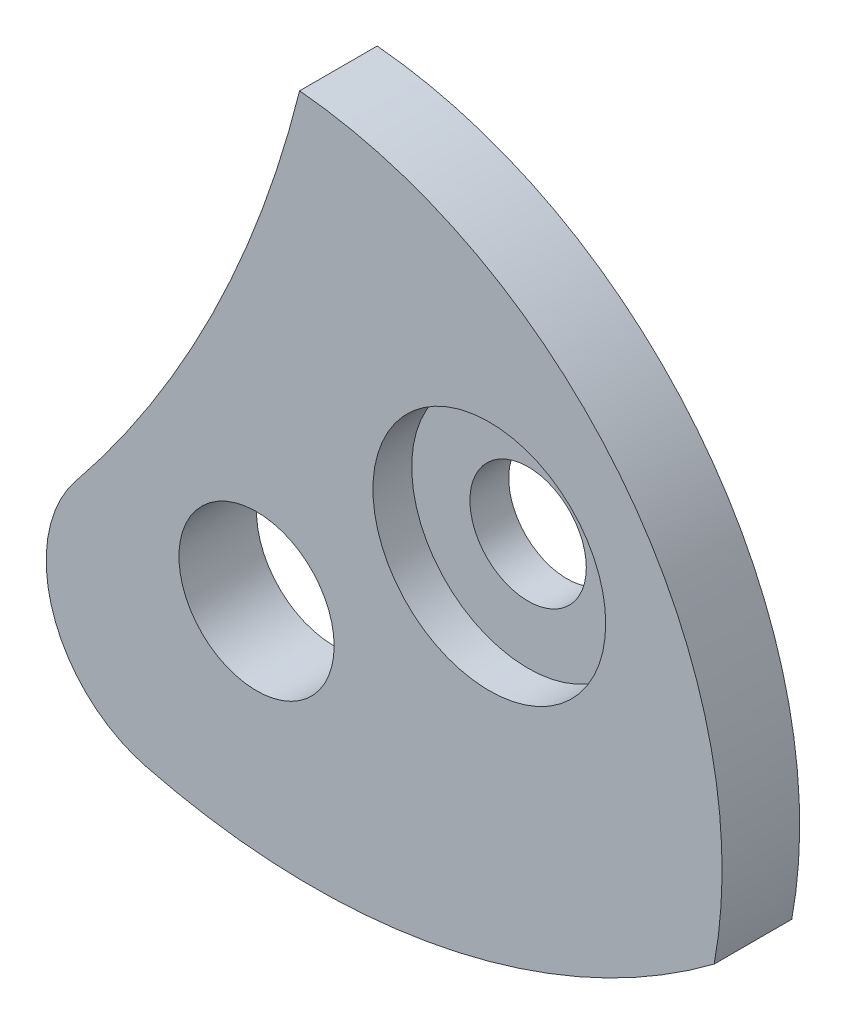
ISO-10303-21;
HEADER;
FILE_DESCRIPTION(('STEP AP214'),'2;1');
FILE_NAME('part.step','',(''),(''),'','','');
FILE_SCHEMA(('AUTOMOTIVE_DESIGN { 1 0 10303 214 1 1 1 1 }'));
ENDSEC;
DATA;
#1=APPLICATION_CONTEXT('core data for automotive mechanical design processes');
#2=APPLICATION_PROTOCOL_DEFINITION('international standard','automotive_design',2000,#1);
#3=PRODUCT_CONTEXT('',#1,'mechanical');
#4=PRODUCT('Part','Part','',(#3));
#5=PRODUCT_RELATED_PRODUCT_CATEGORY('part','',(#4));
#6=PRODUCT_DEFINITION_FORMATION('','',#4);
#7=PRODUCT_DEFINITION_CONTEXT('part definition',#1,'design');
#8=PRODUCT_DEFINITION('design','',#6,#7);
#9=PRODUCT_DEFINITION_SHAPE('','',#8);
#10=(LENGTH_UNIT() NAMED_UNIT(*) SI_UNIT(.MILLI.,.METRE.));
#11=(NAMED_UNIT(*) PLANE_ANGLE_UNIT() SI_UNIT($,.RADIAN.));
#12=(NAMED_UNIT(*) SI_UNIT($,.STERADIAN.) SOLID_ANGLE_UNIT());
#13=UNCERTAINTY_MEASURE_WITH_UNIT(LENGTH_MEASURE(1.E-05),#10,'distance_accuracy_value','');
#14=(GEOMETRIC_REPRESENTATION_CONTEXT(3) GLOBAL_UNCERTAINTY_ASSIGNED_CONTEXT((#13)) GLOBAL_UNIT_ASSIGNED_CONTEXT((#10,
#11,#12)) REPRESENTATION_CONTEXT('',''));
#15=CARTESIAN_POINT('',(0.,0.,0.));
#16=DIRECTION('',(0.,0.,1.));
#17=DIRECTION('',(1.,0.,0.));
#18=AXIS2_PLACEMENT_3D('',#15,#16,#17);
#19=CARTESIAN_POINT('',(-0.070310820055864,1.22652102940601,0.5));
#20=DIRECTION('',(0.,0.,1.));
#21=DIRECTION('',(1.,0.,0.));
#22=AXIS2_PLACEMENT_3D('',#19,#20,#21);
#23=PLANE('',#22);
#24=CARTESIAN_POINT('',(1.5,1.,0.5));
#25=DIRECTION('',(0.,0.,1.));
#26=DIRECTION('',(1.,0.,0.));
#27=AXIS2_PLACEMENT_3D('',#24,#25,#26);
#28=CIRCLE('',#27,0.75);
#29=CARTESIAN_POINT('',(2.25,1.,0.5));
#30=VERTEX_POINT('',#29);
#31=EDGE_CURVE('E121',#30,#30,#28,.T.);
#32=ORIENTED_EDGE('',*,*,#31,.F.);
#33=EDGE_LOOP('',(#32));
#34=FACE_BOUND('',#33,.T.);
#35=CARTESIAN_POINT('',(-0.499999999999994,-0.449999999999992,0.5));
#36=DIRECTION('',(0.,0.,1.));
#37=DIRECTION('',(1.,0.,0.));
#38=AXIS2_PLACEMENT_3D('',#35,#36,#37);
#39=CIRCLE('',#38,0.855387483534204);
#40=CARTESIAN_POINT('',(-1.16544114847209,0.0874716968428477,0.5));
#41=VERTEX_POINT('',#40);
#42=CARTESIAN_POINT('',(-0.712369976180268,-1.27860529819942,0.5));
#43=VERTEX_POINT('',#42);
#44=EDGE_CURVE('E88',#41,#43,#39,.T.);
#45=ORIENTED_EDGE('',*,*,#44,.T.);
#46=CARTESIAN_POINT('',(0.359378359888265,2.90304205881202,0.5));
#47=DIRECTION('',(0.,0.,1.));
#48=DIRECTION('',(1.,0.,0.));
#49=AXIS2_PLACEMENT_3D('',#46,#47,#48);
#50=CIRCLE('',#49,4.31680658754437);
#51=CARTESIAN_POINT('',(2.94901450097416,-0.550739024442707,0.5));
#52=VERTEX_POINT('',#51);
#53=EDGE_CURVE('E83',#43,#52,#50,.T.);
#54=ORIENTED_EDGE('',*,*,#53,.T.);
#55=CARTESIAN_POINT('',(0.,0.,0.5));
#56=DIRECTION('',(0.,0.,1.));
#57=DIRECTION('',(1.,0.,0.));
#58=AXIS2_PLACEMENT_3D('',#55,#56,#57);
#59=CIRCLE('',#58,3.);
#60=CARTESIAN_POINT('',(0.277602425033497,2.98712853650717,0.5));
#61=VERTEX_POINT('',#60);
#62=EDGE_CURVE('E86',#52,#61,#59,.T.);
#63=ORIENTED_EDGE('',*,*,#62,.T.);
#64=CARTESIAN_POINT('',(-6.99999999999999,4.80000000000001,0.5));
#65=DIRECTION('',(0.,0.,-1.));
#66=DIRECTION('',(1.,0.,0.));
#67=AXIS2_PLACEMENT_3D('',#64,#65,#66);
#68=CIRCLE('',#67,7.5);
#69=EDGE_CURVE('E53',#61,#41,#68,.T.);
#70=ORIENTED_EDGE('',*,*,#69,.T.);
#71=EDGE_LOOP('',(#45,#54,#63,#70));
#72=FACE_BOUND('',#71,.T.);
#73=CARTESIAN_POINT('',(0.,0.,0.5));
#74=DIRECTION('',(0.,0.,1.));
#75=DIRECTION('',(1.,0.,0.));
#76=AXIS2_PLACEMENT_3D('',#73,#74,#75);
#77=CIRCLE('',#76,0.500000000000006);
#78=CARTESIAN_POINT('',(0.500000000000006,0.,0.5));
#79=VERTEX_POINT('',#78);
#80=EDGE_CURVE('E103',#79,#79,#77,.T.);
#81=ORIENTED_EDGE('',*,*,#80,.F.);
#82=EDGE_LOOP('',(#81));
#83=FACE_BOUND('',#82,.T.);
#84=ADVANCED_FACE('F36',(#34,#72,#83),#23,.T.);
#85=CARTESIAN_POINT('',(-0.070310820055864,1.22652102940601,0.));
#86=DIRECTION('',(0.,0.,1.));
#87=DIRECTION('',(1.,0.,0.));
#88=AXIS2_PLACEMENT_3D('',#85,#86,#87);
#89=PLANE('',#88);
#90=CARTESIAN_POINT('',(1.5,1.,0.));
#91=DIRECTION('',(0.,0.,1.));
#92=DIRECTION('',(1.,0.,0.));
#93=AXIS2_PLACEMENT_3D('',#90,#91,#92);
#94=CIRCLE('',#93,0.375);
#95=CARTESIAN_POINT('',(1.875,1.,0.));
#96=VERTEX_POINT('',#95);
#97=EDGE_CURVE('E124',#96,#96,#94,.T.);
#98=ORIENTED_EDGE('',*,*,#97,.T.);
#99=EDGE_LOOP('',(#98));
#100=FACE_BOUND('',#99,.T.);
#101=CARTESIAN_POINT('',(-0.499999999999994,-0.449999999999992,0.));
#102=DIRECTION('',(0.,0.,1.));
#103=DIRECTION('',(1.,0.,0.));
#104=AXIS2_PLACEMENT_3D('',#101,#102,#103);
#105=CIRCLE('',#104,0.855387483534204);
#106=CARTESIAN_POINT('',(-1.16544114847209,0.0874716968428477,0.));
#107=VERTEX_POINT('',#106);
#108=CARTESIAN_POINT('',(-0.712369976180268,-1.27860529819942,0.));
#109=VERTEX_POINT('',#108);
#110=EDGE_CURVE('E100',#107,#109,#105,.T.);
#111=ORIENTED_EDGE('',*,*,#110,.F.);
#112=CARTESIAN_POINT('',(-6.99999999999999,4.80000000000001,0.));
#113=DIRECTION('',(0.,0.,-1.));
#114=DIRECTION('',(1.,0.,0.));
#115=AXIS2_PLACEMENT_3D('',#112,#113,#114);
#116=CIRCLE('',#115,7.5);
#117=CARTESIAN_POINT('',(0.277602425033497,2.98712853650717,0.));
#118=VERTEX_POINT('',#117);
#119=EDGE_CURVE('E76',#118,#107,#116,.T.);
#120=ORIENTED_EDGE('',*,*,#119,.F.);
#121=CARTESIAN_POINT('',(0.,0.,0.));
#122=DIRECTION('',(0.,0.,1.));
#123=DIRECTION('',(1.,0.,0.));
#124=AXIS2_PLACEMENT_3D('',#121,#122,#123);
#125=CIRCLE('',#124,3.);
#126=CARTESIAN_POINT('',(2.94901450097416,-0.550739024442707,0.));
#127=VERTEX_POINT('',#126);
#128=EDGE_CURVE('E70',#127,#118,#125,.T.);
#129=ORIENTED_EDGE('',*,*,#128,.F.);
#130=CARTESIAN_POINT('',(0.359378359888265,2.90304205881202,0.));
#131=DIRECTION('',(0.,0.,1.));
#132=DIRECTION('',(1.,0.,0.));
#133=AXIS2_PLACEMENT_3D('',#130,#131,#132);
#134=CIRCLE('',#133,4.31680658754437);
#135=EDGE_CURVE('E92',#109,#127,#134,.T.);
#136=ORIENTED_EDGE('',*,*,#135,.F.);
#137=EDGE_LOOP('',(#111,#120,#129,#136));
#138=FACE_BOUND('',#137,.T.);
#139=CARTESIAN_POINT('',(0.,0.,0.));
#140=DIRECTION('',(0.,0.,1.));
#141=DIRECTION('',(1.,0.,0.));
#142=AXIS2_PLACEMENT_3D('',#139,#140,#141);
#143=CIRCLE('',#142,0.500000000000006);
#144=CARTESIAN_POINT('',(0.500000000000006,0.,0.));
#145=VERTEX_POINT('',#144);
#146=EDGE_CURVE('E115',#145,#145,#143,.T.);
#147=ORIENTED_EDGE('',*,*,#146,.T.);
#148=EDGE_LOOP('',(#147));
#149=FACE_BOUND('',#148,.T.);
#150=ADVANCED_FACE('F111',(#100,#138,#149),#89,.F.);
#151=CARTESIAN_POINT('',(-0.499999999999994,-0.449999999999992,0.5));
#152=DIRECTION('',(0.,0.,-1.));
#153=DIRECTION('',(-1.,0.,0.));
#154=AXIS2_PLACEMENT_3D('',#151,#152,#153);
#155=CYLINDRICAL_SURFACE('',#154,0.855387483534204);
#156=ORIENTED_EDGE('',*,*,#110,.T.);
#157=DIRECTION('',(0.,0.,-1.));
#158=VECTOR('',#157,1.);
#159=CARTESIAN_POINT('',(-0.712369976180268,-1.27860529819942,0.5));
#160=LINE('',#159,#158);
#161=EDGE_CURVE('E11',#43,#109,#160,.T.);
#162=ORIENTED_EDGE('',*,*,#161,.F.);
#163=ORIENTED_EDGE('',*,*,#44,.F.);
#164=DIRECTION('',(0.,0.,-1.));
#165=VECTOR('',#164,1.);
#166=CARTESIAN_POINT('',(-1.16544114847209,0.0874716968428477,0.5));
#167=LINE('',#166,#165);
#168=EDGE_CURVE('E96',#41,#107,#167,.T.);
#169=ORIENTED_EDGE('',*,*,#168,.T.);
#170=EDGE_LOOP('',(#156,#162,#163,#169));
#171=FACE_BOUND('',#170,.T.);
#172=ADVANCED_FACE('F38',(#171),#155,.T.);
#173=CARTESIAN_POINT('',(0.359378359888265,2.90304205881202,0.5));
#174=DIRECTION('',(0.,0.,-1.));
#175=DIRECTION('',(-1.,0.,0.));
#176=AXIS2_PLACEMENT_3D('',#173,#174,#175);
#177=CYLINDRICAL_SURFACE('',#176,4.31680658754437);
#178=ORIENTED_EDGE('',*,*,#135,.T.);
#179=DIRECTION('',(0.,0.,-1.));
#180=VECTOR('',#179,1.);
#181=CARTESIAN_POINT('',(2.94901450097416,-0.550739024442707,0.5));
#182=LINE('',#181,#180);
#183=EDGE_CURVE('E45',#52,#127,#182,.T.);
#184=ORIENTED_EDGE('',*,*,#183,.F.);
#185=ORIENTED_EDGE('',*,*,#53,.F.);
#186=ORIENTED_EDGE('',*,*,#161,.T.);
#187=EDGE_LOOP('',(#178,#184,#185,#186));
#188=FACE_BOUND('',#187,.T.);
#189=ADVANCED_FACE('F91',(#188),#177,.T.);
#190=CARTESIAN_POINT('',(0.,0.,0.5));
#191=DIRECTION('',(0.,0.,-1.));
#192=DIRECTION('',(-1.,0.,0.));
#193=AXIS2_PLACEMENT_3D('',#190,#191,#192);
#194=CYLINDRICAL_SURFACE('',#193,3.);
#195=ORIENTED_EDGE('',*,*,#128,.T.);
#196=DIRECTION('',(0.,0.,-1.));
#197=VECTOR('',#196,1.);
#198=CARTESIAN_POINT('',(0.277602425033497,2.98712853650717,0.5));
#199=LINE('',#198,#197);
#200=EDGE_CURVE('E93',#61,#118,#199,.T.);
#201=ORIENTED_EDGE('',*,*,#200,.F.);
#202=ORIENTED_EDGE('',*,*,#62,.F.);
#203=ORIENTED_EDGE('',*,*,#183,.T.);
#204=EDGE_LOOP('',(#195,#201,#202,#203));
#205=FACE_BOUND('',#204,.T.);
#206=ADVANCED_FACE('F94',(#205),#194,.T.);
#207=CARTESIAN_POINT('',(-6.99999999999999,4.80000000000001,0.5));
#208=DIRECTION('',(0.,0.,-1.));
#209=DIRECTION('',(-1.,0.,0.));
#210=AXIS2_PLACEMENT_3D('',#207,#208,#209);
#211=CYLINDRICAL_SURFACE('',#210,7.5);
#212=ORIENTED_EDGE('',*,*,#119,.T.);
#213=ORIENTED_EDGE('',*,*,#168,.F.);
#214=ORIENTED_EDGE('',*,*,#69,.F.);
#215=ORIENTED_EDGE('',*,*,#200,.T.);
#216=EDGE_LOOP('',(#212,#213,#214,#215));
#217=FACE_BOUND('',#216,.T.);
#218=ADVANCED_FACE('F108',(#217),#211,.F.);
#219=CARTESIAN_POINT('',(0.,0.,0.5));
#220=DIRECTION('',(0.,0.,-1.));
#221=DIRECTION('',(-1.,0.,0.));
#222=AXIS2_PLACEMENT_3D('',#219,#220,#221);
#223=CYLINDRICAL_SURFACE('',#222,0.500000000000006);
#224=ORIENTED_EDGE('',*,*,#80,.T.);
#225=EDGE_LOOP('',(#224));
#226=FACE_BOUND('',#225,.T.);
#227=ORIENTED_EDGE('',*,*,#146,.F.);
#228=EDGE_LOOP('',(#227));
#229=FACE_BOUND('',#228,.T.);
#230=ADVANCED_FACE('F144',(#226,#229),#223,.F.);
#231=CARTESIAN_POINT('',(1.5,1.,0.25));
#232=DIRECTION('',(0.,0.,1.));
#233=DIRECTION('',(1.,0.,0.));
#234=AXIS2_PLACEMENT_3D('',#231,#232,#233);
#235=CYLINDRICAL_SURFACE('',#234,0.75);
#236=CARTESIAN_POINT('',(1.5,1.,0.25));
#237=DIRECTION('',(0.,0.,1.));
#238=DIRECTION('',(1.,0.,0.));
#239=AXIS2_PLACEMENT_3D('',#236,#237,#238);
#240=CIRCLE('',#239,0.75);
#241=CARTESIAN_POINT('',(2.25,1.,0.25));
#242=VERTEX_POINT('',#241);
#243=EDGE_CURVE('E118',#242,#242,#240,.T.);
#244=ORIENTED_EDGE('',*,*,#243,.F.);
#245=EDGE_LOOP('',(#244));
#246=FACE_BOUND('',#245,.T.);
#247=ORIENTED_EDGE('',*,*,#31,.T.);
#248=EDGE_LOOP('',(#247));
#249=FACE_BOUND('',#248,.T.);
#250=ADVANCED_FACE('F138',(#246,#249),#235,.F.);
#251=CARTESIAN_POINT('',(1.5,1.,0.25));
#252=DIRECTION('',(0.,0.,1.));
#253=DIRECTION('',(1.,0.,0.));
#254=AXIS2_PLACEMENT_3D('',#251,#252,#253);
#255=PLANE('',#254);
#256=CARTESIAN_POINT('',(1.5,1.,0.250000000000001));
#257=DIRECTION('',(0.,0.,1.));
#258=DIRECTION('',(1.,0.,0.));
#259=AXIS2_PLACEMENT_3D('',#256,#257,#258);
#260=CIRCLE('',#259,0.374999999999988);
#261=CARTESIAN_POINT('',(1.87499999999999,1.,0.250000000000001));
#262=VERTEX_POINT('',#261);
#263=EDGE_CURVE('E129',#262,#262,#260,.T.);
#264=ORIENTED_EDGE('',*,*,#263,.F.);
#265=EDGE_LOOP('',(#264));
#266=FACE_BOUND('',#265,.T.);
#267=ORIENTED_EDGE('',*,*,#243,.T.);
#268=EDGE_LOOP('',(#267));
#269=FACE_BOUND('',#268,.T.);
#270=ADVANCED_FACE('F135',(#266,#269),#255,.T.);
#271=CARTESIAN_POINT('',(1.5,1.,0.25));
#272=DIRECTION('',(0.,0.,1.));
#273=DIRECTION('',(1.,0.,0.));
#274=AXIS2_PLACEMENT_3D('',#271,#272,#273);
#275=CYLINDRICAL_SURFACE('',#274,0.374999999999994);
#276=ORIENTED_EDGE('',*,*,#97,.F.);
#277=EDGE_LOOP('',(#276));
#278=FACE_BOUND('',#277,.T.);
#279=ORIENTED_EDGE('',*,*,#263,.T.);
#280=EDGE_LOOP('',(#279));
#281=FACE_BOUND('',#280,.T.);
#282=ADVANCED_FACE('F133',(#278,#281),#275,.F.);
#283=CLOSED_SHELL('',(#84,#150,#172,#189,#206,#218,#230,#250,#270,#282));
#284=MANIFOLD_SOLID_BREP('B2',#283);
#285=ADVANCED_BREP_SHAPE_REPRESENTATION('',(#18,#284),#14);
#286=SHAPE_DEFINITION_REPRESENTATION(#9,#285);
ENDSEC;
END-ISO-10303-21;
